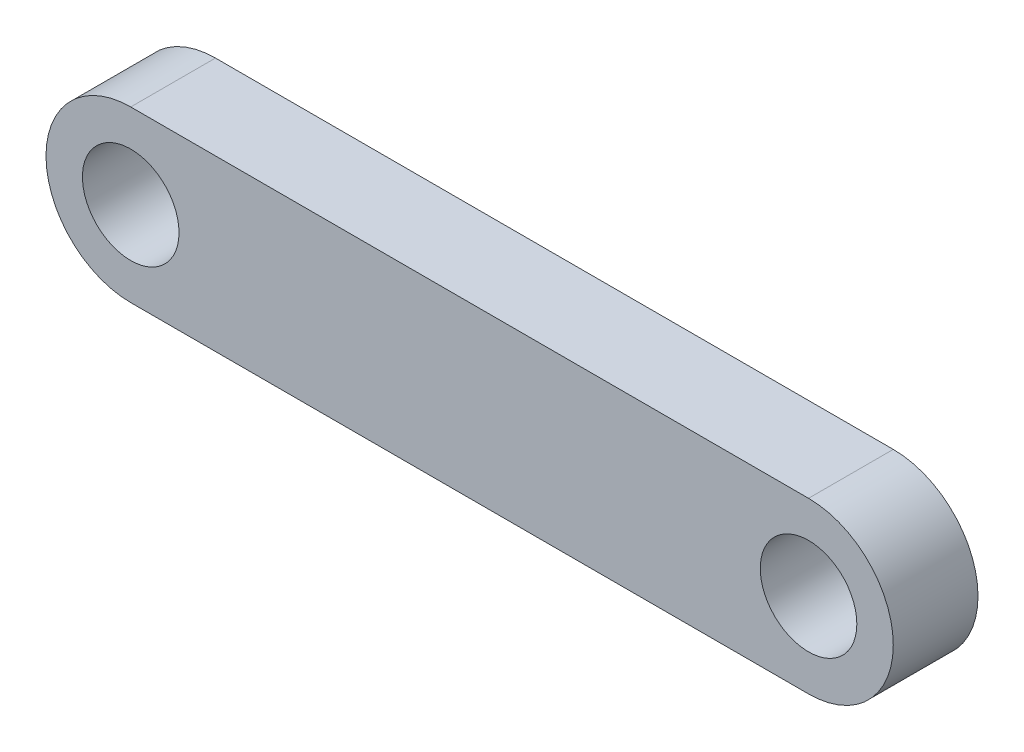
ISO-10303-21;
HEADER;
FILE_DESCRIPTION(('STEP AP214'),'2;1');
FILE_NAME('part.step','',(''),(''),'','','');
FILE_SCHEMA(('AUTOMOTIVE_DESIGN { 1 0 10303 214 1 1 1 1 }'));
ENDSEC;
DATA;
#1=APPLICATION_CONTEXT('core data for automotive mechanical design processes');
#2=APPLICATION_PROTOCOL_DEFINITION('international standard','automotive_design',2000,#1);
#3=PRODUCT_CONTEXT('',#1,'mechanical');
#4=PRODUCT('Part','Part','',(#3));
#5=PRODUCT_RELATED_PRODUCT_CATEGORY('part','',(#4));
#6=PRODUCT_DEFINITION_FORMATION('','',#4);
#7=PRODUCT_DEFINITION_CONTEXT('part definition',#1,'design');
#8=PRODUCT_DEFINITION('design','',#6,#7);
#9=PRODUCT_DEFINITION_SHAPE('','',#8);
#10=(LENGTH_UNIT() NAMED_UNIT(*) SI_UNIT(.MILLI.,.METRE.));
#11=(NAMED_UNIT(*) PLANE_ANGLE_UNIT() SI_UNIT($,.RADIAN.));
#12=(NAMED_UNIT(*) SI_UNIT($,.STERADIAN.) SOLID_ANGLE_UNIT());
#13=UNCERTAINTY_MEASURE_WITH_UNIT(LENGTH_MEASURE(1.E-05),#10,'distance_accuracy_value','');
#14=(GEOMETRIC_REPRESENTATION_CONTEXT(3) GLOBAL_UNCERTAINTY_ASSIGNED_CONTEXT((#13)) GLOBAL_UNIT_ASSIGNED_CONTEXT((#10,
#11,#12)) REPRESENTATION_CONTEXT('',''));
#15=CARTESIAN_POINT('',(0.,0.,0.));
#16=DIRECTION('',(0.,0.,1.));
#17=DIRECTION('',(1.,0.,0.));
#18=AXIS2_PLACEMENT_3D('',#15,#16,#17);
#19=CARTESIAN_POINT('',(-20.,0.,2.5));
#20=DIRECTION('',(0.,0.,1.));
#21=DIRECTION('',(1.,0.,0.));
#22=AXIS2_PLACEMENT_3D('',#19,#20,#21);
#23=PLANE('',#22);
#24=CARTESIAN_POINT('',(-20.,0.,2.5));
#25=DIRECTION('',(0.,0.,1.));
#26=DIRECTION('',(1.,0.,0.));
#27=AXIS2_PLACEMENT_3D('',#24,#25,#26);
#28=CIRCLE('',#27,2.85);
#29=CARTESIAN_POINT('',(-17.15,0.,2.5));
#30=VERTEX_POINT('',#29);
#31=EDGE_CURVE('E83',#30,#30,#28,.T.);
#32=ORIENTED_EDGE('',*,*,#31,.F.);
#33=EDGE_LOOP('',(#32));
#34=FACE_BOUND('',#33,.T.);
#35=CARTESIAN_POINT('',(-20.,0.,2.5));
#36=DIRECTION('',(0.,0.,1.));
#37=DIRECTION('',(1.,0.,0.));
#38=AXIS2_PLACEMENT_3D('',#35,#36,#37);
#39=CIRCLE('',#38,5.);
#40=CARTESIAN_POINT('',(-20.,5.,2.5));
#41=VERTEX_POINT('',#40);
#42=CARTESIAN_POINT('',(-20.,-5.,2.5));
#43=VERTEX_POINT('',#42);
#44=EDGE_CURVE('E68',#41,#43,#39,.T.);
#45=ORIENTED_EDGE('',*,*,#44,.T.);
#46=DIRECTION('',(1.,0.,0.));
#47=VECTOR('',#46,1.);
#48=CARTESIAN_POINT('',(-20.,-5.,2.5));
#49=LINE('',#48,#47);
#50=CARTESIAN_POINT('',(20.,-5.,2.5));
#51=VERTEX_POINT('',#50);
#52=EDGE_CURVE('E63',#43,#51,#49,.T.);
#53=ORIENTED_EDGE('',*,*,#52,.T.);
#54=CARTESIAN_POINT('',(20.,0.,2.5));
#55=DIRECTION('',(0.,0.,1.));
#56=DIRECTION('',(1.,0.,0.));
#57=AXIS2_PLACEMENT_3D('',#54,#55,#56);
#58=CIRCLE('',#57,5.);
#59=CARTESIAN_POINT('',(20.,5.,2.5));
#60=VERTEX_POINT('',#59);
#61=EDGE_CURVE('E66',#51,#60,#58,.T.);
#62=ORIENTED_EDGE('',*,*,#61,.T.);
#63=DIRECTION('',(-1.,0.,0.));
#64=VECTOR('',#63,1.);
#65=CARTESIAN_POINT('',(-20.,5.,2.5));
#66=LINE('',#65,#64);
#67=EDGE_CURVE('E33',#60,#41,#66,.T.);
#68=ORIENTED_EDGE('',*,*,#67,.T.);
#69=EDGE_LOOP('',(#45,#53,#62,#68));
#70=FACE_BOUND('',#69,.T.);
#71=CARTESIAN_POINT('',(20.,0.,2.5));
#72=DIRECTION('',(0.,0.,1.));
#73=DIRECTION('',(1.,0.,0.));
#74=AXIS2_PLACEMENT_3D('',#71,#72,#73);
#75=CIRCLE('',#74,2.85);
#76=CARTESIAN_POINT('',(22.85,0.,2.5));
#77=VERTEX_POINT('',#76);
#78=EDGE_CURVE('E98',#77,#77,#75,.T.);
#79=ORIENTED_EDGE('',*,*,#78,.F.);
#80=EDGE_LOOP('',(#79));
#81=FACE_BOUND('',#80,.T.);
#82=ADVANCED_FACE('F16',(#34,#70,#81),#23,.T.);
#83=CARTESIAN_POINT('',(-20.,0.,-2.5));
#84=DIRECTION('',(0.,0.,1.));
#85=DIRECTION('',(1.,0.,0.));
#86=AXIS2_PLACEMENT_3D('',#83,#84,#85);
#87=PLANE('',#86);
#88=CARTESIAN_POINT('',(-20.,0.,-2.5));
#89=DIRECTION('',(0.,0.,1.));
#90=DIRECTION('',(1.,0.,0.));
#91=AXIS2_PLACEMENT_3D('',#88,#89,#90);
#92=CIRCLE('',#91,5.);
#93=CARTESIAN_POINT('',(-20.,5.,-2.5));
#94=VERTEX_POINT('',#93);
#95=CARTESIAN_POINT('',(-20.,-5.,-2.5));
#96=VERTEX_POINT('',#95);
#97=EDGE_CURVE('E80',#94,#96,#92,.T.);
#98=ORIENTED_EDGE('',*,*,#97,.F.);
#99=DIRECTION('',(-1.,0.,0.));
#100=VECTOR('',#99,1.);
#101=CARTESIAN_POINT('',(-20.,5.,-2.5));
#102=LINE('',#101,#100);
#103=CARTESIAN_POINT('',(20.,5.,-2.5));
#104=VERTEX_POINT('',#103);
#105=EDGE_CURVE('E56',#104,#94,#102,.T.);
#106=ORIENTED_EDGE('',*,*,#105,.F.);
#107=CARTESIAN_POINT('',(20.,0.,-2.5));
#108=DIRECTION('',(0.,0.,1.));
#109=DIRECTION('',(1.,0.,0.));
#110=AXIS2_PLACEMENT_3D('',#107,#108,#109);
#111=CIRCLE('',#110,5.);
#112=CARTESIAN_POINT('',(20.,-5.,-2.5));
#113=VERTEX_POINT('',#112);
#114=EDGE_CURVE('E50',#113,#104,#111,.T.);
#115=ORIENTED_EDGE('',*,*,#114,.F.);
#116=DIRECTION('',(1.,0.,0.));
#117=VECTOR('',#116,1.);
#118=CARTESIAN_POINT('',(-20.,-5.,-2.5));
#119=LINE('',#118,#117);
#120=EDGE_CURVE('E72',#96,#113,#119,.T.);
#121=ORIENTED_EDGE('',*,*,#120,.F.);
#122=EDGE_LOOP('',(#98,#106,#115,#121));
#123=FACE_BOUND('',#122,.T.);
#124=CARTESIAN_POINT('',(-20.,0.,-2.5));
#125=DIRECTION('',(0.,0.,1.));
#126=DIRECTION('',(1.,0.,0.));
#127=AXIS2_PLACEMENT_3D('',#124,#125,#126);
#128=CIRCLE('',#127,2.85);
#129=CARTESIAN_POINT('',(-17.15,0.,-2.5));
#130=VERTEX_POINT('',#129);
#131=EDGE_CURVE('E95',#130,#130,#128,.T.);
#132=ORIENTED_EDGE('',*,*,#131,.T.);
#133=EDGE_LOOP('',(#132));
#134=FACE_BOUND('',#133,.T.);
#135=CARTESIAN_POINT('',(20.,0.,-2.5));
#136=DIRECTION('',(0.,0.,1.));
#137=DIRECTION('',(1.,0.,0.));
#138=AXIS2_PLACEMENT_3D('',#135,#136,#137);
#139=CIRCLE('',#138,2.85);
#140=CARTESIAN_POINT('',(22.85,0.,-2.5));
#141=VERTEX_POINT('',#140);
#142=EDGE_CURVE('E101',#141,#141,#139,.T.);
#143=ORIENTED_EDGE('',*,*,#142,.T.);
#144=EDGE_LOOP('',(#143));
#145=FACE_BOUND('',#144,.T.);
#146=ADVANCED_FACE('F91',(#123,#134,#145),#87,.F.);
#147=CARTESIAN_POINT('',(-20.,0.,2.5));
#148=DIRECTION('',(0.,0.,-1.));
#149=DIRECTION('',(-1.,0.,0.));
#150=AXIS2_PLACEMENT_3D('',#147,#148,#149);
#151=CYLINDRICAL_SURFACE('',#150,5.);
#152=ORIENTED_EDGE('',*,*,#97,.T.);
#153=DIRECTION('',(0.,0.,-1.));
#154=VECTOR('',#153,1.);
#155=CARTESIAN_POINT('',(-20.,-5.,2.5));
#156=LINE('',#155,#154);
#157=EDGE_CURVE('E11',#43,#96,#156,.T.);
#158=ORIENTED_EDGE('',*,*,#157,.F.);
#159=ORIENTED_EDGE('',*,*,#44,.F.);
#160=DIRECTION('',(0.,0.,-1.));
#161=VECTOR('',#160,1.);
#162=CARTESIAN_POINT('',(-20.,5.,2.5));
#163=LINE('',#162,#161);
#164=EDGE_CURVE('E76',#41,#94,#163,.T.);
#165=ORIENTED_EDGE('',*,*,#164,.T.);
#166=EDGE_LOOP('',(#152,#158,#159,#165));
#167=FACE_BOUND('',#166,.T.);
#168=ADVANCED_FACE('F18',(#167),#151,.T.);
#169=CARTESIAN_POINT('',(-20.,-5.,2.5));
#170=DIRECTION('',(0.,1.,0.));
#171=DIRECTION('',(-1.,0.,0.));
#172=AXIS2_PLACEMENT_3D('',#169,#170,#171);
#173=PLANE('',#172);
#174=ORIENTED_EDGE('',*,*,#120,.T.);
#175=DIRECTION('',(0.,0.,-1.));
#176=VECTOR('',#175,1.);
#177=CARTESIAN_POINT('',(20.,-5.,2.5));
#178=LINE('',#177,#176);
#179=EDGE_CURVE('E25',#51,#113,#178,.T.);
#180=ORIENTED_EDGE('',*,*,#179,.F.);
#181=ORIENTED_EDGE('',*,*,#52,.F.);
#182=ORIENTED_EDGE('',*,*,#157,.T.);
#183=EDGE_LOOP('',(#174,#180,#181,#182));
#184=FACE_BOUND('',#183,.T.);
#185=ADVANCED_FACE('F71',(#184),#173,.F.);
#186=CARTESIAN_POINT('',(20.,0.,2.5));
#187=DIRECTION('',(0.,0.,-1.));
#188=DIRECTION('',(-1.,0.,0.));
#189=AXIS2_PLACEMENT_3D('',#186,#187,#188);
#190=CYLINDRICAL_SURFACE('',#189,5.);
#191=ORIENTED_EDGE('',*,*,#114,.T.);
#192=DIRECTION('',(0.,0.,-1.));
#193=VECTOR('',#192,1.);
#194=CARTESIAN_POINT('',(20.,5.,2.5));
#195=LINE('',#194,#193);
#196=EDGE_CURVE('E73',#60,#104,#195,.T.);
#197=ORIENTED_EDGE('',*,*,#196,.F.);
#198=ORIENTED_EDGE('',*,*,#61,.F.);
#199=ORIENTED_EDGE('',*,*,#179,.T.);
#200=EDGE_LOOP('',(#191,#197,#198,#199));
#201=FACE_BOUND('',#200,.T.);
#202=ADVANCED_FACE('F74',(#201),#190,.T.);
#203=CARTESIAN_POINT('',(-20.,5.,2.5));
#204=DIRECTION('',(0.,-1.,0.));
#205=DIRECTION('',(1.,0.,0.));
#206=AXIS2_PLACEMENT_3D('',#203,#204,#205);
#207=PLANE('',#206);
#208=ORIENTED_EDGE('',*,*,#105,.T.);
#209=ORIENTED_EDGE('',*,*,#164,.F.);
#210=ORIENTED_EDGE('',*,*,#67,.F.);
#211=ORIENTED_EDGE('',*,*,#196,.T.);
#212=EDGE_LOOP('',(#208,#209,#210,#211));
#213=FACE_BOUND('',#212,.T.);
#214=ADVANCED_FACE('F88',(#213),#207,.F.);
#215=CARTESIAN_POINT('',(-20.,0.,2.5));
#216=DIRECTION('',(0.,0.,-1.));
#217=DIRECTION('',(-1.,0.,0.));
#218=AXIS2_PLACEMENT_3D('',#215,#216,#217);
#219=CYLINDRICAL_SURFACE('',#218,2.85);
#220=ORIENTED_EDGE('',*,*,#31,.T.);
#221=EDGE_LOOP('',(#220));
#222=FACE_BOUND('',#221,.T.);
#223=ORIENTED_EDGE('',*,*,#131,.F.);
#224=EDGE_LOOP('',(#223));
#225=FACE_BOUND('',#224,.T.);
#226=ADVANCED_FACE('F120',(#222,#225),#219,.F.);
#227=CARTESIAN_POINT('',(20.,0.,2.5));
#228=DIRECTION('',(0.,0.,-1.));
#229=DIRECTION('',(-1.,0.,0.));
#230=AXIS2_PLACEMENT_3D('',#227,#228,#229);
#231=CYLINDRICAL_SURFACE('',#230,2.85);
#232=ORIENTED_EDGE('',*,*,#78,.T.);
#233=EDGE_LOOP('',(#232));
#234=FACE_BOUND('',#233,.T.);
#235=ORIENTED_EDGE('',*,*,#142,.F.);
#236=EDGE_LOOP('',(#235));
#237=FACE_BOUND('',#236,.T.);
#238=ADVANCED_FACE('F107',(#234,#237),#231,.F.);
#239=CLOSED_SHELL('',(#82,#146,#168,#185,#202,#214,#226,#238));
#240=MANIFOLD_SOLID_BREP('B1',#239);
#241=ADVANCED_BREP_SHAPE_REPRESENTATION('',(#18,#240),#14);
#242=SHAPE_DEFINITION_REPRESENTATION(#9,#241);
ENDSEC;
END-ISO-10303-21;
